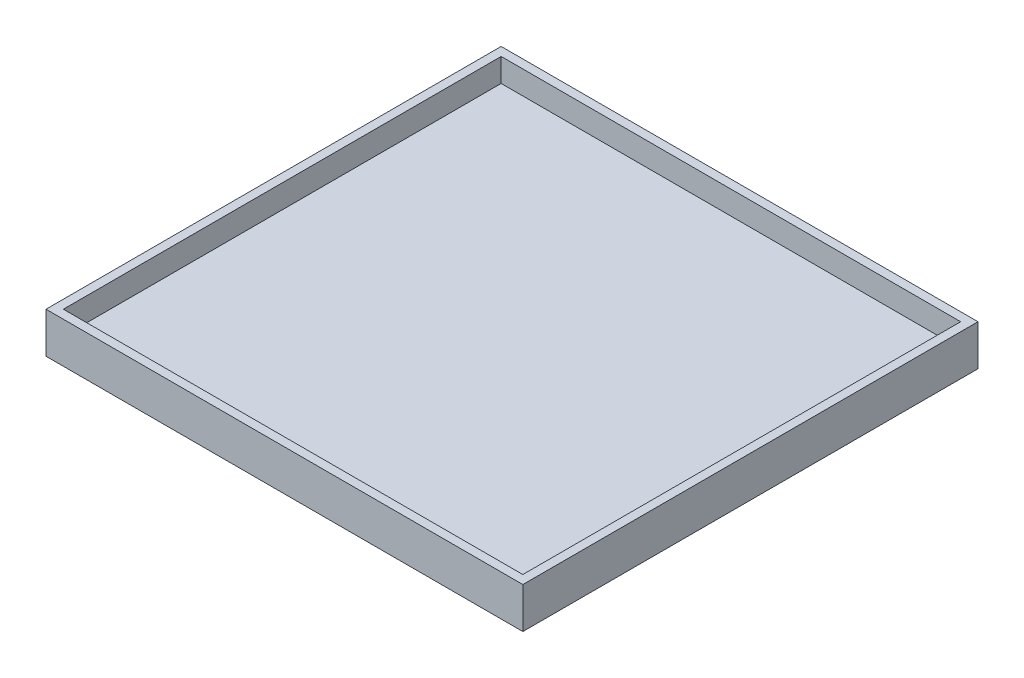
ISO-10303-21;
HEADER;
FILE_DESCRIPTION(('STEP AP214'),'2;1');
FILE_NAME('part.step','',(''),(''),'','','');
FILE_SCHEMA(('AUTOMOTIVE_DESIGN { 1 0 10303 214 1 1 1 1 }'));
ENDSEC;
DATA;
#1=APPLICATION_CONTEXT('core data for automotive mechanical design processes');
#2=APPLICATION_PROTOCOL_DEFINITION('international standard','automotive_design',2000,#1);
#3=PRODUCT_CONTEXT('',#1,'mechanical');
#4=PRODUCT('Part','Part','',(#3));
#5=PRODUCT_RELATED_PRODUCT_CATEGORY('part','',(#4));
#6=PRODUCT_DEFINITION_FORMATION('','',#4);
#7=PRODUCT_DEFINITION_CONTEXT('part definition',#1,'design');
#8=PRODUCT_DEFINITION('design','',#6,#7);
#9=PRODUCT_DEFINITION_SHAPE('','',#8);
#10=(LENGTH_UNIT() NAMED_UNIT(*) SI_UNIT(.MILLI.,.METRE.));
#11=(NAMED_UNIT(*) PLANE_ANGLE_UNIT() SI_UNIT($,.RADIAN.));
#12=(NAMED_UNIT(*) SI_UNIT($,.STERADIAN.) SOLID_ANGLE_UNIT());
#13=UNCERTAINTY_MEASURE_WITH_UNIT(LENGTH_MEASURE(1.E-05),#10,'distance_accuracy_value','');
#14=(GEOMETRIC_REPRESENTATION_CONTEXT(3) GLOBAL_UNCERTAINTY_ASSIGNED_CONTEXT((#13)) GLOBAL_UNIT_ASSIGNED_CONTEXT((#10,
#11,#12)) REPRESENTATION_CONTEXT('',''));
#15=CARTESIAN_POINT('',(0.,0.,0.));
#16=DIRECTION('',(0.,0.,1.));
#17=DIRECTION('',(1.,0.,0.));
#18=AXIS2_PLACEMENT_3D('',#15,#16,#17);
#19=CARTESIAN_POINT('',(55.,-5.4,-52.5));
#20=DIRECTION('',(1.,0.,0.));
#21=DIRECTION('',(0.,0.,-1.));
#22=AXIS2_PLACEMENT_3D('',#19,#20,#21);
#23=PLANE('',#22);
#24=DIRECTION('',(0.,0.,-1.));
#25=VECTOR('',#24,1.);
#26=CARTESIAN_POINT('',(55.,0.,-52.5));
#27=LINE('',#26,#25);
#28=CARTESIAN_POINT('',(55.,0.,52.5));
#29=VERTEX_POINT('',#28);
#30=CARTESIAN_POINT('',(55.,0.,-52.5));
#31=VERTEX_POINT('',#30);
#32=EDGE_CURVE('E148',#29,#31,#27,.T.);
#33=ORIENTED_EDGE('',*,*,#32,.F.);
#34=DIRECTION('',(0.,1.,0.));
#35=VECTOR('',#34,1.);
#36=CARTESIAN_POINT('',(55.,-5.4,52.5));
#37=LINE('',#36,#35);
#38=CARTESIAN_POINT('',(55.,-9.4,52.5));
#39=VERTEX_POINT('',#38);
#40=EDGE_CURVE('E11',#39,#29,#37,.T.);
#41=ORIENTED_EDGE('',*,*,#40,.F.);
#42=DIRECTION('',(0.,0.,1.));
#43=VECTOR('',#42,1.);
#44=CARTESIAN_POINT('',(55.,-9.4,52.5));
#45=LINE('',#44,#43);
#46=CARTESIAN_POINT('',(55.,-9.4,-52.5));
#47=VERTEX_POINT('',#46);
#48=EDGE_CURVE('E114',#47,#39,#45,.T.);
#49=ORIENTED_EDGE('',*,*,#48,.F.);
#50=DIRECTION('',(0.,1.,0.));
#51=VECTOR('',#50,1.);
#52=CARTESIAN_POINT('',(55.,-5.4,-52.5));
#53=LINE('',#52,#51);
#54=EDGE_CURVE('E36',#47,#31,#53,.T.);
#55=ORIENTED_EDGE('',*,*,#54,.T.);
#56=EDGE_LOOP('',(#33,#41,#49,#55));
#57=FACE_BOUND('',#56,.T.);
#58=ADVANCED_FACE('F33',(#57),#23,.T.);
#59=CARTESIAN_POINT('',(-55.,-5.4,52.5));
#60=DIRECTION('',(0.,0.,1.));
#61=DIRECTION('',(1.,0.,0.));
#62=AXIS2_PLACEMENT_3D('',#59,#60,#61);
#63=PLANE('',#62);
#64=DIRECTION('',(1.,0.,0.));
#65=VECTOR('',#64,1.);
#66=CARTESIAN_POINT('',(-55.,0.,52.5));
#67=LINE('',#66,#65);
#68=CARTESIAN_POINT('',(-55.,0.,52.5));
#69=VERTEX_POINT('',#68);
#70=EDGE_CURVE('E159',#69,#29,#67,.T.);
#71=ORIENTED_EDGE('',*,*,#70,.F.);
#72=DIRECTION('',(0.,1.,0.));
#73=VECTOR('',#72,1.);
#74=CARTESIAN_POINT('',(-55.,-5.4,52.5));
#75=LINE('',#74,#73);
#76=CARTESIAN_POINT('',(-55.,-9.4,52.5));
#77=VERTEX_POINT('',#76);
#78=EDGE_CURVE('E41',#77,#69,#75,.T.);
#79=ORIENTED_EDGE('',*,*,#78,.F.);
#80=DIRECTION('',(-1.,0.,0.));
#81=VECTOR('',#80,1.);
#82=CARTESIAN_POINT('',(-55.,-9.4,52.5));
#83=LINE('',#82,#81);
#84=EDGE_CURVE('E118',#39,#77,#83,.T.);
#85=ORIENTED_EDGE('',*,*,#84,.F.);
#86=ORIENTED_EDGE('',*,*,#40,.T.);
#87=EDGE_LOOP('',(#71,#79,#85,#86));
#88=FACE_BOUND('',#87,.T.);
#89=ADVANCED_FACE('F164',(#88),#63,.T.);
#90=CARTESIAN_POINT('',(-55.,-5.4,-52.5));
#91=DIRECTION('',(-1.,0.,0.));
#92=DIRECTION('',(0.,0.,1.));
#93=AXIS2_PLACEMENT_3D('',#90,#91,#92);
#94=PLANE('',#93);
#95=DIRECTION('',(0.,0.,1.));
#96=VECTOR('',#95,1.);
#97=CARTESIAN_POINT('',(-55.,0.,-52.5));
#98=LINE('',#97,#96);
#99=CARTESIAN_POINT('',(-55.,0.,-52.5));
#100=VERTEX_POINT('',#99);
#101=EDGE_CURVE('E104',#100,#69,#98,.T.);
#102=ORIENTED_EDGE('',*,*,#101,.F.);
#103=DIRECTION('',(0.,1.,0.));
#104=VECTOR('',#103,1.);
#105=CARTESIAN_POINT('',(-55.,-5.4,-52.5));
#106=LINE('',#105,#104);
#107=CARTESIAN_POINT('',(-55.,-9.4,-52.5));
#108=VERTEX_POINT('',#107);
#109=EDGE_CURVE('E98',#108,#100,#106,.T.);
#110=ORIENTED_EDGE('',*,*,#109,.F.);
#111=DIRECTION('',(0.,0.,-1.));
#112=VECTOR('',#111,1.);
#113=CARTESIAN_POINT('',(-55.,-9.4,52.5));
#114=LINE('',#113,#112);
#115=EDGE_CURVE('E102',#77,#108,#114,.T.);
#116=ORIENTED_EDGE('',*,*,#115,.F.);
#117=ORIENTED_EDGE('',*,*,#78,.T.);
#118=EDGE_LOOP('',(#102,#110,#116,#117));
#119=FACE_BOUND('',#118,.T.);
#120=ADVANCED_FACE('F100',(#119),#94,.T.);
#121=CARTESIAN_POINT('',(-55.,-5.4,-52.5));
#122=DIRECTION('',(0.,0.,-1.));
#123=DIRECTION('',(-1.,0.,0.));
#124=AXIS2_PLACEMENT_3D('',#121,#122,#123);
#125=PLANE('',#124);
#126=DIRECTION('',(-1.,0.,0.));
#127=VECTOR('',#126,1.);
#128=CARTESIAN_POINT('',(-55.,0.,-52.5));
#129=LINE('',#128,#127);
#130=EDGE_CURVE('E156',#31,#100,#129,.T.);
#131=ORIENTED_EDGE('',*,*,#130,.F.);
#132=ORIENTED_EDGE('',*,*,#54,.F.);
#133=DIRECTION('',(1.,0.,0.));
#134=VECTOR('',#133,1.);
#135=CARTESIAN_POINT('',(-55.,-9.4,-52.5));
#136=LINE('',#135,#134);
#137=EDGE_CURVE('E109',#108,#47,#136,.T.);
#138=ORIENTED_EDGE('',*,*,#137,.F.);
#139=ORIENTED_EDGE('',*,*,#109,.T.);
#140=EDGE_LOOP('',(#131,#132,#138,#139));
#141=FACE_BOUND('',#140,.T.);
#142=ADVANCED_FACE('F110',(#141),#125,.T.);
#143=CARTESIAN_POINT('',(0.,0.,0.));
#144=DIRECTION('',(0.,1.,0.));
#145=DIRECTION('',(0.,0.,1.));
#146=AXIS2_PLACEMENT_3D('',#143,#144,#145);
#147=PLANE('',#146);
#148=DIRECTION('',(0.,0.,1.));
#149=VECTOR('',#148,1.);
#150=CARTESIAN_POINT('',(-53.,0.,-50.5));
#151=LINE('',#150,#149);
#152=CARTESIAN_POINT('',(-53.,0.,-50.5));
#153=VERTEX_POINT('',#152);
#154=CARTESIAN_POINT('',(-53.,0.,50.5));
#155=VERTEX_POINT('',#154);
#156=EDGE_CURVE('E49',#153,#155,#151,.T.);
#157=ORIENTED_EDGE('',*,*,#156,.F.);
#158=DIRECTION('',(-1.,0.,0.));
#159=VECTOR('',#158,1.);
#160=CARTESIAN_POINT('',(-53.,0.,-50.5));
#161=LINE('',#160,#159);
#162=CARTESIAN_POINT('',(53.,0.,-50.5));
#163=VERTEX_POINT('',#162);
#164=EDGE_CURVE('E127',#163,#153,#161,.T.);
#165=ORIENTED_EDGE('',*,*,#164,.F.);
#166=DIRECTION('',(0.,0.,-1.));
#167=VECTOR('',#166,1.);
#168=CARTESIAN_POINT('',(53.,0.,-50.5));
#169=LINE('',#168,#167);
#170=CARTESIAN_POINT('',(53.,0.,50.5));
#171=VERTEX_POINT('',#170);
#172=EDGE_CURVE('E141',#171,#163,#169,.T.);
#173=ORIENTED_EDGE('',*,*,#172,.F.);
#174=DIRECTION('',(1.,0.,0.));
#175=VECTOR('',#174,1.);
#176=CARTESIAN_POINT('',(-53.,0.,50.5));
#177=LINE('',#176,#175);
#178=EDGE_CURVE('E138',#155,#171,#177,.T.);
#179=ORIENTED_EDGE('',*,*,#178,.F.);
#180=EDGE_LOOP('',(#157,#165,#173,#179));
#181=FACE_BOUND('',#180,.T.);
#182=ORIENTED_EDGE('',*,*,#32,.T.);
#183=ORIENTED_EDGE('',*,*,#130,.T.);
#184=ORIENTED_EDGE('',*,*,#101,.T.);
#185=ORIENTED_EDGE('',*,*,#70,.T.);
#186=EDGE_LOOP('',(#182,#183,#184,#185));
#187=FACE_BOUND('',#186,.T.);
#188=ADVANCED_FACE('F163',(#181,#187),#147,.T.);
#189=CARTESIAN_POINT('',(-53.,-5.4,-50.5));
#190=DIRECTION('',(-1.,0.,0.));
#191=DIRECTION('',(0.,0.,1.));
#192=AXIS2_PLACEMENT_3D('',#189,#190,#191);
#193=PLANE('',#192);
#194=ORIENTED_EDGE('',*,*,#156,.T.);
#195=DIRECTION('',(0.,1.,0.));
#196=VECTOR('',#195,1.);
#197=CARTESIAN_POINT('',(-53.,-5.4,50.5));
#198=LINE('',#197,#196);
#199=CARTESIAN_POINT('',(-53.,-5.4,50.5));
#200=VERTEX_POINT('',#199);
#201=EDGE_CURVE('E136',#200,#155,#198,.T.);
#202=ORIENTED_EDGE('',*,*,#201,.F.);
#203=DIRECTION('',(0.,0.,1.));
#204=VECTOR('',#203,1.);
#205=CARTESIAN_POINT('',(-53.,-5.4,-50.5));
#206=LINE('',#205,#204);
#207=CARTESIAN_POINT('',(-53.,-5.4,-50.5));
#208=VERTEX_POINT('',#207);
#209=EDGE_CURVE('E123',#208,#200,#206,.T.);
#210=ORIENTED_EDGE('',*,*,#209,.F.);
#211=DIRECTION('',(0.,1.,0.));
#212=VECTOR('',#211,1.);
#213=CARTESIAN_POINT('',(-53.,-5.4,-50.5));
#214=LINE('',#213,#212);
#215=EDGE_CURVE('E146',#208,#153,#214,.T.);
#216=ORIENTED_EDGE('',*,*,#215,.T.);
#217=EDGE_LOOP('',(#194,#202,#210,#216));
#218=FACE_BOUND('',#217,.T.);
#219=ADVANCED_FACE('F179',(#218),#193,.F.);
#220=CARTESIAN_POINT('',(-53.,-5.4,-50.5));
#221=DIRECTION('',(0.,0.,-1.));
#222=DIRECTION('',(-1.,0.,0.));
#223=AXIS2_PLACEMENT_3D('',#220,#221,#222);
#224=PLANE('',#223);
#225=ORIENTED_EDGE('',*,*,#164,.T.);
#226=ORIENTED_EDGE('',*,*,#215,.F.);
#227=DIRECTION('',(-1.,0.,0.));
#228=VECTOR('',#227,1.);
#229=CARTESIAN_POINT('',(-53.,-5.4,-50.5));
#230=LINE('',#229,#228);
#231=CARTESIAN_POINT('',(53.,-5.4,-50.5));
#232=VERTEX_POINT('',#231);
#233=EDGE_CURVE('E133',#232,#208,#230,.T.);
#234=ORIENTED_EDGE('',*,*,#233,.F.);
#235=DIRECTION('',(0.,1.,0.));
#236=VECTOR('',#235,1.);
#237=CARTESIAN_POINT('',(53.,-5.4,-50.5));
#238=LINE('',#237,#236);
#239=EDGE_CURVE('E149',#232,#163,#238,.T.);
#240=ORIENTED_EDGE('',*,*,#239,.T.);
#241=EDGE_LOOP('',(#225,#226,#234,#240));
#242=FACE_BOUND('',#241,.T.);
#243=ADVANCED_FACE('F184',(#242),#224,.F.);
#244=CARTESIAN_POINT('',(53.,-5.4,-50.5));
#245=DIRECTION('',(1.,0.,0.));
#246=DIRECTION('',(0.,0.,-1.));
#247=AXIS2_PLACEMENT_3D('',#244,#245,#246);
#248=PLANE('',#247);
#249=ORIENTED_EDGE('',*,*,#172,.T.);
#250=ORIENTED_EDGE('',*,*,#239,.F.);
#251=DIRECTION('',(0.,0.,-1.));
#252=VECTOR('',#251,1.);
#253=CARTESIAN_POINT('',(53.,-5.4,-50.5));
#254=LINE('',#253,#252);
#255=CARTESIAN_POINT('',(53.,-5.4,50.5));
#256=VERTEX_POINT('',#255);
#257=EDGE_CURVE('E130',#256,#232,#254,.T.);
#258=ORIENTED_EDGE('',*,*,#257,.F.);
#259=DIRECTION('',(0.,1.,0.));
#260=VECTOR('',#259,1.);
#261=CARTESIAN_POINT('',(53.,-5.4,50.5));
#262=LINE('',#261,#260);
#263=EDGE_CURVE('E151',#256,#171,#262,.T.);
#264=ORIENTED_EDGE('',*,*,#263,.T.);
#265=EDGE_LOOP('',(#249,#250,#258,#264));
#266=FACE_BOUND('',#265,.T.);
#267=ADVANCED_FACE('F198',(#266),#248,.F.);
#268=CARTESIAN_POINT('',(-53.,-5.4,50.5));
#269=DIRECTION('',(0.,0.,1.));
#270=DIRECTION('',(1.,0.,0.));
#271=AXIS2_PLACEMENT_3D('',#268,#269,#270);
#272=PLANE('',#271);
#273=ORIENTED_EDGE('',*,*,#178,.T.);
#274=ORIENTED_EDGE('',*,*,#263,.F.);
#275=DIRECTION('',(1.,0.,0.));
#276=VECTOR('',#275,1.);
#277=CARTESIAN_POINT('',(-53.,-5.4,50.5));
#278=LINE('',#277,#276);
#279=EDGE_CURVE('E126',#200,#256,#278,.T.);
#280=ORIENTED_EDGE('',*,*,#279,.F.);
#281=ORIENTED_EDGE('',*,*,#201,.T.);
#282=EDGE_LOOP('',(#273,#274,#280,#281));
#283=FACE_BOUND('',#282,.T.);
#284=ADVANCED_FACE('F189',(#283),#272,.F.);
#285=CARTESIAN_POINT('',(0.,-5.4,0.));
#286=DIRECTION('',(0.,-1.,0.));
#287=DIRECTION('',(0.,0.,-1.));
#288=AXIS2_PLACEMENT_3D('',#285,#286,#287);
#289=PLANE('',#288);
#290=ORIENTED_EDGE('',*,*,#233,.T.);
#291=ORIENTED_EDGE('',*,*,#209,.T.);
#292=ORIENTED_EDGE('',*,*,#279,.T.);
#293=ORIENTED_EDGE('',*,*,#257,.T.);
#294=EDGE_LOOP('',(#290,#291,#292,#293));
#295=FACE_BOUND('',#294,.T.);
#296=ADVANCED_FACE('F195',(#295),#289,.F.);
#297=CARTESIAN_POINT('',(0.,-9.4,0.));
#298=DIRECTION('',(0.,-1.,0.));
#299=DIRECTION('',(0.,0.,-1.));
#300=AXIS2_PLACEMENT_3D('',#297,#298,#299);
#301=PLANE('',#300);
#302=ORIENTED_EDGE('',*,*,#115,.T.);
#303=ORIENTED_EDGE('',*,*,#137,.T.);
#304=ORIENTED_EDGE('',*,*,#48,.T.);
#305=ORIENTED_EDGE('',*,*,#84,.T.);
#306=EDGE_LOOP('',(#302,#303,#304,#305));
#307=FACE_BOUND('',#306,.T.);
#308=ADVANCED_FACE('F117',(#307),#301,.T.);
#309=CLOSED_SHELL('',(#58,#89,#120,#142,#188,#219,#243,#267,#284,#296,#308));
#310=MANIFOLD_SOLID_BREP('B2',#309);
#311=ADVANCED_BREP_SHAPE_REPRESENTATION('',(#18,#310),#14);
#312=SHAPE_DEFINITION_REPRESENTATION(#9,#311);
ENDSEC;
END-ISO-10303-21;
